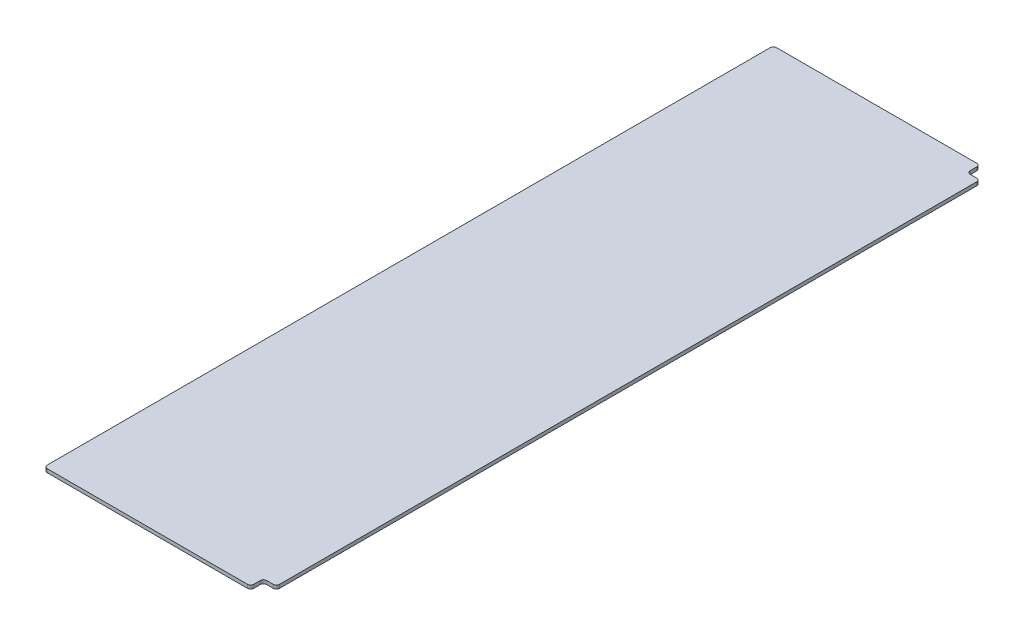
ISO-10303-21;
HEADER;
FILE_DESCRIPTION(('STEP AP214'),'2;1');
FILE_NAME('part.step','',(''),(''),'','','');
FILE_SCHEMA(('AUTOMOTIVE_DESIGN { 1 0 10303 214 1 1 1 1 }'));
ENDSEC;
DATA;
#1=APPLICATION_CONTEXT('core data for automotive mechanical design processes');
#2=APPLICATION_PROTOCOL_DEFINITION('international standard','automotive_design',2000,#1);
#3=PRODUCT_CONTEXT('',#1,'mechanical');
#4=PRODUCT('Part','Part','',(#3));
#5=PRODUCT_RELATED_PRODUCT_CATEGORY('part','',(#4));
#6=PRODUCT_DEFINITION_FORMATION('','',#4);
#7=PRODUCT_DEFINITION_CONTEXT('part definition',#1,'design');
#8=PRODUCT_DEFINITION('design','',#6,#7);
#9=PRODUCT_DEFINITION_SHAPE('','',#8);
#10=(LENGTH_UNIT() NAMED_UNIT(*) SI_UNIT(.MILLI.,.METRE.));
#11=(NAMED_UNIT(*) PLANE_ANGLE_UNIT() SI_UNIT($,.RADIAN.));
#12=(NAMED_UNIT(*) SI_UNIT($,.STERADIAN.) SOLID_ANGLE_UNIT());
#13=UNCERTAINTY_MEASURE_WITH_UNIT(LENGTH_MEASURE(1.E-05),#10,'distance_accuracy_value','');
#14=(GEOMETRIC_REPRESENTATION_CONTEXT(3) GLOBAL_UNCERTAINTY_ASSIGNED_CONTEXT((#13)) GLOBAL_UNIT_ASSIGNED_CONTEXT((#10,
#11,#12)) REPRESENTATION_CONTEXT('',''));
#15=CARTESIAN_POINT('',(0.,0.,0.));
#16=DIRECTION('',(0.,0.,1.));
#17=DIRECTION('',(1.,0.,0.));
#18=AXIS2_PLACEMENT_3D('',#15,#16,#17);
#19=CARTESIAN_POINT('',(190.5,2.778125,0.));
#20=DIRECTION('',(-1.,0.,0.));
#21=DIRECTION('',(0.,0.,1.));
#22=AXIS2_PLACEMENT_3D('',#19,#20,#21);
#23=PLANE('',#22);
#24=DIRECTION('',(0.,0.,-1.));
#25=VECTOR('',#24,1.);
#26=CARTESIAN_POINT('',(190.5,2.778125,0.));
#27=LINE('',#26,#25);
#28=CARTESIAN_POINT('',(190.5,2.778125,-30.48));
#29=VERTEX_POINT('',#28);
#30=CARTESIAN_POINT('',(190.5,2.778125,-579.12));
#31=VERTEX_POINT('',#30);
#32=EDGE_CURVE('E182',#29,#31,#27,.T.);
#33=ORIENTED_EDGE('',*,*,#32,.F.);
#34=DIRECTION('',(0.,1.,0.));
#35=VECTOR('',#34,1.);
#36=CARTESIAN_POINT('',(190.5,2.778125,-30.48));
#37=LINE('',#36,#35);
#38=CARTESIAN_POINT('',(190.5,0.,-30.48));
#39=VERTEX_POINT('',#38);
#40=EDGE_CURVE('E238',#29,#39,#37,.F.);
#41=ORIENTED_EDGE('',*,*,#40,.T.);
#42=DIRECTION('',(0.,0.,-1.));
#43=VECTOR('',#42,1.);
#44=CARTESIAN_POINT('',(190.5,0.,0.));
#45=LINE('',#44,#43);
#46=CARTESIAN_POINT('',(190.5,0.,-579.12));
#47=VERTEX_POINT('',#46);
#48=EDGE_CURVE('E185',#39,#47,#45,.T.);
#49=ORIENTED_EDGE('',*,*,#48,.T.);
#50=DIRECTION('',(0.,1.,0.));
#51=VECTOR('',#50,1.);
#52=CARTESIAN_POINT('',(190.5,2.778125,-579.12));
#53=LINE('',#52,#51);
#54=EDGE_CURVE('E235',#47,#31,#53,.T.);
#55=ORIENTED_EDGE('',*,*,#54,.T.);
#56=EDGE_LOOP('',(#33,#41,#49,#55));
#57=FACE_BOUND('',#56,.T.);
#58=ADVANCED_FACE('F33',(#57),#23,.F.);
#59=CARTESIAN_POINT('',(0.,2.778125,0.));
#60=DIRECTION('',(0.,-1.,0.));
#61=DIRECTION('',(0.,0.,-1.));
#62=AXIS2_PLACEMENT_3D('',#59,#60,#61);
#63=PLANE('',#62);
#64=DIRECTION('',(1.,0.,0.));
#65=VECTOR('',#64,1.);
#66=CARTESIAN_POINT('',(0.,2.778125,-591.82));
#67=LINE('',#66,#65);
#68=CARTESIAN_POINT('',(20.32,2.778125,-591.82));
#69=VERTEX_POINT('',#68);
#70=CARTESIAN_POINT('',(177.8,2.778125,-591.82));
#71=VERTEX_POINT('',#70);
#72=EDGE_CURVE('E164',#69,#71,#67,.T.);
#73=ORIENTED_EDGE('',*,*,#72,.F.);
#74=CARTESIAN_POINT('',(20.32,2.778125,-589.28));
#75=DIRECTION('',(0.,-1.,0.));
#76=DIRECTION('',(0.,0.,-1.));
#77=AXIS2_PLACEMENT_3D('',#74,#75,#76);
#78=CIRCLE('',#77,2.54);
#79=CARTESIAN_POINT('',(17.78,2.778125,-589.28));
#80=VERTEX_POINT('',#79);
#81=EDGE_CURVE('E147',#69,#80,#78,.F.);
#82=ORIENTED_EDGE('',*,*,#81,.T.);
#83=DIRECTION('',(0.,0.,-1.));
#84=VECTOR('',#83,1.);
#85=CARTESIAN_POINT('',(17.78,2.778125,-591.82));
#86=LINE('',#85,#84);
#87=CARTESIAN_POINT('',(17.78,2.778125,-20.32));
#88=VERTEX_POINT('',#87);
#89=EDGE_CURVE('E178',#88,#80,#86,.T.);
#90=ORIENTED_EDGE('',*,*,#89,.F.);
#91=CARTESIAN_POINT('',(20.32,2.778125,-20.32));
#92=DIRECTION('',(0.,-1.,0.));
#93=DIRECTION('',(0.,0.,-1.));
#94=AXIS2_PLACEMENT_3D('',#91,#92,#93);
#95=CIRCLE('',#94,2.54);
#96=CARTESIAN_POINT('',(20.32,2.778125,-17.78));
#97=VERTEX_POINT('',#96);
#98=EDGE_CURVE('E158',#88,#97,#95,.F.);
#99=ORIENTED_EDGE('',*,*,#98,.T.);
#100=DIRECTION('',(-1.,0.,0.));
#101=VECTOR('',#100,1.);
#102=CARTESIAN_POINT('',(0.,2.778125,-17.78));
#103=LINE('',#102,#101);
#104=CARTESIAN_POINT('',(177.8,2.778125,-17.78));
#105=VERTEX_POINT('',#104);
#106=EDGE_CURVE('E175',#105,#97,#103,.T.);
#107=ORIENTED_EDGE('',*,*,#106,.F.);
#108=CARTESIAN_POINT('',(177.8,2.778125,-20.32));
#109=DIRECTION('',(0.,-1.,0.));
#110=DIRECTION('',(0.,0.,-1.));
#111=AXIS2_PLACEMENT_3D('',#108,#109,#110);
#112=CIRCLE('',#111,2.54);
#113=CARTESIAN_POINT('',(180.34,2.778125,-20.32));
#114=VERTEX_POINT('',#113);
#115=EDGE_CURVE('E192',#105,#114,#112,.F.);
#116=ORIENTED_EDGE('',*,*,#115,.T.);
#117=DIRECTION('',(0.,0.,1.));
#118=VECTOR('',#117,1.);
#119=CARTESIAN_POINT('',(180.34,2.778125,-17.78));
#120=LINE('',#119,#118);
#121=CARTESIAN_POINT('',(180.34,2.778125,-25.4));
#122=VERTEX_POINT('',#121);
#123=EDGE_CURVE('E272',#122,#114,#120,.T.);
#124=ORIENTED_EDGE('',*,*,#123,.F.);
#125=CARTESIAN_POINT('',(182.88,2.778125,-25.4));
#126=DIRECTION('',(0.,-1.,0.));
#127=DIRECTION('',(0.,0.,-1.));
#128=AXIS2_PLACEMENT_3D('',#125,#126,#127);
#129=CIRCLE('',#128,2.54);
#130=CARTESIAN_POINT('',(182.88,2.778125,-27.94));
#131=VERTEX_POINT('',#130);
#132=EDGE_CURVE('E240',#122,#131,#129,.T.);
#133=ORIENTED_EDGE('',*,*,#132,.T.);
#134=DIRECTION('',(-1.,0.,0.));
#135=VECTOR('',#134,1.);
#136=CARTESIAN_POINT('',(190.5,2.778125,-27.94));
#137=LINE('',#136,#135);
#138=CARTESIAN_POINT('',(187.96,2.778125,-27.94));
#139=VERTEX_POINT('',#138);
#140=EDGE_CURVE('E275',#139,#131,#137,.T.);
#141=ORIENTED_EDGE('',*,*,#140,.F.);
#142=CARTESIAN_POINT('',(187.96,2.778125,-30.48));
#143=DIRECTION('',(0.,-1.,0.));
#144=DIRECTION('',(0.,0.,-1.));
#145=AXIS2_PLACEMENT_3D('',#142,#143,#144);
#146=CIRCLE('',#145,2.54);
#147=EDGE_CURVE('E194',#139,#29,#146,.F.);
#148=ORIENTED_EDGE('',*,*,#147,.T.);
#149=ORIENTED_EDGE('',*,*,#32,.T.);
#150=CARTESIAN_POINT('',(187.96,2.778125,-579.12));
#151=DIRECTION('',(0.,-1.,0.));
#152=DIRECTION('',(0.,0.,-1.));
#153=AXIS2_PLACEMENT_3D('',#150,#151,#152);
#154=CIRCLE('',#153,2.54);
#155=CARTESIAN_POINT('',(187.96,2.778125,-581.66));
#156=VERTEX_POINT('',#155);
#157=EDGE_CURVE('E167',#31,#156,#154,.F.);
#158=ORIENTED_EDGE('',*,*,#157,.T.);
#159=DIRECTION('',(1.,0.,0.));
#160=VECTOR('',#159,1.);
#161=CARTESIAN_POINT('',(190.5,2.778125,-581.66));
#162=LINE('',#161,#160);
#163=CARTESIAN_POINT('',(182.88,2.778125,-581.66));
#164=VERTEX_POINT('',#163);
#165=EDGE_CURVE('E246',#164,#156,#162,.T.);
#166=ORIENTED_EDGE('',*,*,#165,.F.);
#167=CARTESIAN_POINT('',(182.88,2.778125,-584.2));
#168=DIRECTION('',(0.,-1.,0.));
#169=DIRECTION('',(0.,0.,-1.));
#170=AXIS2_PLACEMENT_3D('',#167,#168,#169);
#171=CIRCLE('',#170,2.54);
#172=CARTESIAN_POINT('',(180.34,2.778125,-584.2));
#173=VERTEX_POINT('',#172);
#174=EDGE_CURVE('E41',#164,#173,#171,.T.);
#175=ORIENTED_EDGE('',*,*,#174,.T.);
#176=DIRECTION('',(0.,0.,1.));
#177=VECTOR('',#176,1.);
#178=CARTESIAN_POINT('',(180.34,2.778125,-591.82));
#179=LINE('',#178,#177);
#180=CARTESIAN_POINT('',(180.34,2.778125,-589.28));
#181=VERTEX_POINT('',#180);
#182=EDGE_CURVE('E244',#181,#173,#179,.T.);
#183=ORIENTED_EDGE('',*,*,#182,.F.);
#184=CARTESIAN_POINT('',(177.8,2.778125,-589.28));
#185=DIRECTION('',(0.,-1.,0.));
#186=DIRECTION('',(0.,0.,-1.));
#187=AXIS2_PLACEMENT_3D('',#184,#185,#186);
#188=CIRCLE('',#187,2.54);
#189=EDGE_CURVE('E172',#181,#71,#188,.F.);
#190=ORIENTED_EDGE('',*,*,#189,.T.);
#191=EDGE_LOOP('',(#73,#82,#90,#99,#107,#116,#124,#133,#141,#148,#149,#158,#166,#175,#183,#190));
#192=FACE_BOUND('',#191,.T.);
#193=ADVANCED_FACE('F170',(#192),#63,.F.);
#194=CARTESIAN_POINT('',(0.,0.,0.));
#195=DIRECTION('',(0.,-1.,0.));
#196=DIRECTION('',(0.,0.,-1.));
#197=AXIS2_PLACEMENT_3D('',#194,#195,#196);
#198=PLANE('',#197);
#199=DIRECTION('',(0.,0.,-1.));
#200=VECTOR('',#199,1.);
#201=CARTESIAN_POINT('',(17.78,0.,-591.82));
#202=LINE('',#201,#200);
#203=CARTESIAN_POINT('',(17.78,0.,-20.32));
#204=VERTEX_POINT('',#203);
#205=CARTESIAN_POINT('',(17.78,0.,-589.28));
#206=VERTEX_POINT('',#205);
#207=EDGE_CURVE('E173',#204,#206,#202,.T.);
#208=ORIENTED_EDGE('',*,*,#207,.T.);
#209=CARTESIAN_POINT('',(20.32,0.,-589.28));
#210=DIRECTION('',(0.,-1.,0.));
#211=DIRECTION('',(0.,0.,-1.));
#212=AXIS2_PLACEMENT_3D('',#209,#210,#211);
#213=CIRCLE('',#212,2.54);
#214=CARTESIAN_POINT('',(20.32,0.,-591.82));
#215=VERTEX_POINT('',#214);
#216=EDGE_CURVE('E209',#206,#215,#213,.T.);
#217=ORIENTED_EDGE('',*,*,#216,.T.);
#218=DIRECTION('',(1.,0.,0.));
#219=VECTOR('',#218,1.);
#220=CARTESIAN_POINT('',(0.,0.,-591.82));
#221=LINE('',#220,#219);
#222=CARTESIAN_POINT('',(177.8,0.,-591.82));
#223=VERTEX_POINT('',#222);
#224=EDGE_CURVE('E166',#215,#223,#221,.T.);
#225=ORIENTED_EDGE('',*,*,#224,.T.);
#226=CARTESIAN_POINT('',(177.8,0.,-589.28));
#227=DIRECTION('',(0.,-1.,0.));
#228=DIRECTION('',(0.,0.,-1.));
#229=AXIS2_PLACEMENT_3D('',#226,#227,#228);
#230=CIRCLE('',#229,2.54);
#231=CARTESIAN_POINT('',(180.34,0.,-589.28));
#232=VERTEX_POINT('',#231);
#233=EDGE_CURVE('E55',#223,#232,#230,.T.);
#234=ORIENTED_EDGE('',*,*,#233,.T.);
#235=DIRECTION('',(0.,0.,1.));
#236=VECTOR('',#235,1.);
#237=CARTESIAN_POINT('',(180.34,0.,-591.82));
#238=LINE('',#237,#236);
#239=CARTESIAN_POINT('',(180.34,0.,-584.2));
#240=VERTEX_POINT('',#239);
#241=EDGE_CURVE('E260',#232,#240,#238,.T.);
#242=ORIENTED_EDGE('',*,*,#241,.T.);
#243=CARTESIAN_POINT('',(182.88,0.,-584.2));
#244=DIRECTION('',(0.,-1.,0.));
#245=DIRECTION('',(0.,0.,-1.));
#246=AXIS2_PLACEMENT_3D('',#243,#244,#245);
#247=CIRCLE('',#246,2.54);
#248=CARTESIAN_POINT('',(182.88,0.,-581.66));
#249=VERTEX_POINT('',#248);
#250=EDGE_CURVE('E11',#240,#249,#247,.F.);
#251=ORIENTED_EDGE('',*,*,#250,.T.);
#252=DIRECTION('',(1.,0.,0.));
#253=VECTOR('',#252,1.);
#254=CARTESIAN_POINT('',(190.5,0.,-581.66));
#255=LINE('',#254,#253);
#256=CARTESIAN_POINT('',(187.96,0.,-581.66));
#257=VERTEX_POINT('',#256);
#258=EDGE_CURVE('E258',#249,#257,#255,.T.);
#259=ORIENTED_EDGE('',*,*,#258,.T.);
#260=CARTESIAN_POINT('',(187.96,0.,-579.12));
#261=DIRECTION('',(0.,-1.,0.));
#262=DIRECTION('',(0.,0.,-1.));
#263=AXIS2_PLACEMENT_3D('',#260,#261,#262);
#264=CIRCLE('',#263,2.54);
#265=EDGE_CURVE('E200',#257,#47,#264,.T.);
#266=ORIENTED_EDGE('',*,*,#265,.T.);
#267=ORIENTED_EDGE('',*,*,#48,.F.);
#268=CARTESIAN_POINT('',(187.96,0.,-30.48));
#269=DIRECTION('',(0.,-1.,0.));
#270=DIRECTION('',(0.,0.,-1.));
#271=AXIS2_PLACEMENT_3D('',#268,#269,#270);
#272=CIRCLE('',#271,2.54);
#273=CARTESIAN_POINT('',(187.96,0.,-27.94));
#274=VERTEX_POINT('',#273);
#275=EDGE_CURVE('E205',#39,#274,#272,.T.);
#276=ORIENTED_EDGE('',*,*,#275,.T.);
#277=DIRECTION('',(-1.,0.,0.));
#278=VECTOR('',#277,1.);
#279=CARTESIAN_POINT('',(190.5,0.,-27.94));
#280=LINE('',#279,#278);
#281=CARTESIAN_POINT('',(182.88,0.,-27.94));
#282=VERTEX_POINT('',#281);
#283=EDGE_CURVE('E269',#274,#282,#280,.T.);
#284=ORIENTED_EDGE('',*,*,#283,.T.);
#285=CARTESIAN_POINT('',(182.88,0.,-25.4));
#286=DIRECTION('',(0.,-1.,0.));
#287=DIRECTION('',(0.,0.,-1.));
#288=AXIS2_PLACEMENT_3D('',#285,#286,#287);
#289=CIRCLE('',#288,2.54);
#290=CARTESIAN_POINT('',(180.34,0.,-25.4));
#291=VERTEX_POINT('',#290);
#292=EDGE_CURVE('E242',#282,#291,#289,.F.);
#293=ORIENTED_EDGE('',*,*,#292,.T.);
#294=DIRECTION('',(0.,0.,1.));
#295=VECTOR('',#294,1.);
#296=CARTESIAN_POINT('',(180.34,0.,-17.78));
#297=LINE('',#296,#295);
#298=CARTESIAN_POINT('',(180.34,0.,-20.32));
#299=VERTEX_POINT('',#298);
#300=EDGE_CURVE('E251',#291,#299,#297,.T.);
#301=ORIENTED_EDGE('',*,*,#300,.T.);
#302=CARTESIAN_POINT('',(177.8,0.,-20.32));
#303=DIRECTION('',(0.,-1.,0.));
#304=DIRECTION('',(0.,0.,-1.));
#305=AXIS2_PLACEMENT_3D('',#302,#303,#304);
#306=CIRCLE('',#305,2.54);
#307=CARTESIAN_POINT('',(177.8,0.,-17.78));
#308=VERTEX_POINT('',#307);
#309=EDGE_CURVE('E203',#299,#308,#306,.T.);
#310=ORIENTED_EDGE('',*,*,#309,.T.);
#311=DIRECTION('',(-1.,0.,0.));
#312=VECTOR('',#311,1.);
#313=CARTESIAN_POINT('',(0.,0.,-17.78));
#314=LINE('',#313,#312);
#315=CARTESIAN_POINT('',(20.32,0.,-17.78));
#316=VERTEX_POINT('',#315);
#317=EDGE_CURVE('E188',#308,#316,#314,.T.);
#318=ORIENTED_EDGE('',*,*,#317,.T.);
#319=CARTESIAN_POINT('',(20.32,0.,-20.32));
#320=DIRECTION('',(0.,-1.,0.));
#321=DIRECTION('',(0.,0.,-1.));
#322=AXIS2_PLACEMENT_3D('',#319,#320,#321);
#323=CIRCLE('',#322,2.54);
#324=EDGE_CURVE('E207',#316,#204,#323,.T.);
#325=ORIENTED_EDGE('',*,*,#324,.T.);
#326=EDGE_LOOP('',(#208,#217,#225,#234,#242,#251,#259,#266,#267,#276,#284,#293,#301,#310,#318,#325));
#327=FACE_BOUND('',#326,.T.);
#328=ADVANCED_FACE('F257',(#327),#198,.T.);
#329=CARTESIAN_POINT('',(0.,0.,-591.82));
#330=DIRECTION('',(0.,0.,1.));
#331=DIRECTION('',(1.,0.,0.));
#332=AXIS2_PLACEMENT_3D('',#329,#330,#331);
#333=PLANE('',#332);
#334=ORIENTED_EDGE('',*,*,#224,.F.);
#335=DIRECTION('',(0.,1.,0.));
#336=VECTOR('',#335,1.);
#337=CARTESIAN_POINT('',(20.32,0.,-591.82));
#338=LINE('',#337,#336);
#339=EDGE_CURVE('E151',#215,#69,#338,.T.);
#340=ORIENTED_EDGE('',*,*,#339,.T.);
#341=ORIENTED_EDGE('',*,*,#72,.T.);
#342=DIRECTION('',(0.,1.,0.));
#343=VECTOR('',#342,1.);
#344=CARTESIAN_POINT('',(177.8,0.,-591.82));
#345=LINE('',#344,#343);
#346=EDGE_CURVE('E168',#71,#223,#345,.F.);
#347=ORIENTED_EDGE('',*,*,#346,.T.);
#348=EDGE_LOOP('',(#334,#340,#341,#347));
#349=FACE_BOUND('',#348,.T.);
#350=ADVANCED_FACE('F163',(#349),#333,.F.);
#351=CARTESIAN_POINT('',(0.,0.,-17.78));
#352=DIRECTION('',(0.,0.,-1.));
#353=DIRECTION('',(-1.,0.,0.));
#354=AXIS2_PLACEMENT_3D('',#351,#352,#353);
#355=PLANE('',#354);
#356=ORIENTED_EDGE('',*,*,#106,.T.);
#357=DIRECTION('',(0.,1.,0.));
#358=VECTOR('',#357,1.);
#359=CARTESIAN_POINT('',(20.32,0.,-17.78));
#360=LINE('',#359,#358);
#361=EDGE_CURVE('E214',#97,#316,#360,.F.);
#362=ORIENTED_EDGE('',*,*,#361,.T.);
#363=ORIENTED_EDGE('',*,*,#317,.F.);
#364=DIRECTION('',(0.,1.,0.));
#365=VECTOR('',#364,1.);
#366=CARTESIAN_POINT('',(177.8,0.,-17.78));
#367=LINE('',#366,#365);
#368=EDGE_CURVE('E211',#308,#105,#367,.T.);
#369=ORIENTED_EDGE('',*,*,#368,.T.);
#370=EDGE_LOOP('',(#356,#362,#363,#369));
#371=FACE_BOUND('',#370,.T.);
#372=ADVANCED_FACE('F285',(#371),#355,.F.);
#373=CARTESIAN_POINT('',(17.78,0.,-591.82));
#374=DIRECTION('',(1.,0.,0.));
#375=DIRECTION('',(0.,0.,-1.));
#376=AXIS2_PLACEMENT_3D('',#373,#374,#375);
#377=PLANE('',#376);
#378=ORIENTED_EDGE('',*,*,#89,.T.);
#379=DIRECTION('',(0.,1.,0.));
#380=VECTOR('',#379,1.);
#381=CARTESIAN_POINT('',(17.78,0.,-589.28));
#382=LINE('',#381,#380);
#383=EDGE_CURVE('E152',#80,#206,#382,.F.);
#384=ORIENTED_EDGE('',*,*,#383,.T.);
#385=ORIENTED_EDGE('',*,*,#207,.F.);
#386=DIRECTION('',(0.,1.,0.));
#387=VECTOR('',#386,1.);
#388=CARTESIAN_POINT('',(17.78,0.,-20.32));
#389=LINE('',#388,#387);
#390=EDGE_CURVE('E157',#204,#88,#389,.T.);
#391=ORIENTED_EDGE('',*,*,#390,.T.);
#392=EDGE_LOOP('',(#378,#384,#385,#391));
#393=FACE_BOUND('',#392,.T.);
#394=ADVANCED_FACE('F294',(#393),#377,.F.);
#395=CARTESIAN_POINT('',(180.34,0.,-17.78));
#396=DIRECTION('',(-1.,0.,0.));
#397=DIRECTION('',(0.,0.,1.));
#398=AXIS2_PLACEMENT_3D('',#395,#396,#397);
#399=PLANE('',#398);
#400=ORIENTED_EDGE('',*,*,#300,.F.);
#401=DIRECTION('',(0.,1.,0.));
#402=VECTOR('',#401,1.);
#403=CARTESIAN_POINT('',(180.34,2.778125,-25.4));
#404=LINE('',#403,#402);
#405=EDGE_CURVE('E218',#291,#122,#404,.T.);
#406=ORIENTED_EDGE('',*,*,#405,.T.);
#407=ORIENTED_EDGE('',*,*,#123,.T.);
#408=DIRECTION('',(0.,1.,0.));
#409=VECTOR('',#408,1.);
#410=CARTESIAN_POINT('',(180.34,0.,-20.32));
#411=LINE('',#410,#409);
#412=EDGE_CURVE('E216',#114,#299,#411,.F.);
#413=ORIENTED_EDGE('',*,*,#412,.T.);
#414=EDGE_LOOP('',(#400,#406,#407,#413));
#415=FACE_BOUND('',#414,.T.);
#416=ADVANCED_FACE('F296',(#415),#399,.F.);
#417=CARTESIAN_POINT('',(190.5,0.,-27.94));
#418=DIRECTION('',(0.,0.,-1.));
#419=DIRECTION('',(-1.,0.,0.));
#420=AXIS2_PLACEMENT_3D('',#417,#418,#419);
#421=PLANE('',#420);
#422=ORIENTED_EDGE('',*,*,#140,.T.);
#423=DIRECTION('',(0.,1.,0.));
#424=VECTOR('',#423,1.);
#425=CARTESIAN_POINT('',(182.88,0.,-27.94));
#426=LINE('',#425,#424);
#427=EDGE_CURVE('E224',#131,#282,#426,.F.);
#428=ORIENTED_EDGE('',*,*,#427,.T.);
#429=ORIENTED_EDGE('',*,*,#283,.F.);
#430=DIRECTION('',(0.,1.,0.));
#431=VECTOR('',#430,1.);
#432=CARTESIAN_POINT('',(187.96,0.,-27.94));
#433=LINE('',#432,#431);
#434=EDGE_CURVE('E221',#274,#139,#433,.T.);
#435=ORIENTED_EDGE('',*,*,#434,.T.);
#436=EDGE_LOOP('',(#422,#428,#429,#435));
#437=FACE_BOUND('',#436,.T.);
#438=ADVANCED_FACE('F302',(#437),#421,.F.);
#439=CARTESIAN_POINT('',(190.5,0.,-581.66));
#440=DIRECTION('',(0.,0.,1.));
#441=DIRECTION('',(1.,0.,0.));
#442=AXIS2_PLACEMENT_3D('',#439,#440,#441);
#443=PLANE('',#442);
#444=ORIENTED_EDGE('',*,*,#258,.F.);
#445=DIRECTION('',(0.,1.,0.));
#446=VECTOR('',#445,1.);
#447=CARTESIAN_POINT('',(182.88,2.778125,-581.66));
#448=LINE('',#447,#446);
#449=EDGE_CURVE('E228',#249,#164,#448,.T.);
#450=ORIENTED_EDGE('',*,*,#449,.T.);
#451=ORIENTED_EDGE('',*,*,#165,.T.);
#452=DIRECTION('',(0.,1.,0.));
#453=VECTOR('',#452,1.);
#454=CARTESIAN_POINT('',(187.96,0.,-581.66));
#455=LINE('',#454,#453);
#456=EDGE_CURVE('E226',#156,#257,#455,.F.);
#457=ORIENTED_EDGE('',*,*,#456,.T.);
#458=EDGE_LOOP('',(#444,#450,#451,#457));
#459=FACE_BOUND('',#458,.T.);
#460=ADVANCED_FACE('F262',(#459),#443,.F.);
#461=CARTESIAN_POINT('',(180.34,0.,-591.82));
#462=DIRECTION('',(-1.,0.,0.));
#463=DIRECTION('',(0.,0.,1.));
#464=AXIS2_PLACEMENT_3D('',#461,#462,#463);
#465=PLANE('',#464);
#466=ORIENTED_EDGE('',*,*,#182,.T.);
#467=DIRECTION('',(0.,1.,0.));
#468=VECTOR('',#467,1.);
#469=CARTESIAN_POINT('',(180.34,0.,-584.2));
#470=LINE('',#469,#468);
#471=EDGE_CURVE('E48',#173,#240,#470,.F.);
#472=ORIENTED_EDGE('',*,*,#471,.T.);
#473=ORIENTED_EDGE('',*,*,#241,.F.);
#474=DIRECTION('',(0.,1.,0.));
#475=VECTOR('',#474,1.);
#476=CARTESIAN_POINT('',(180.34,0.,-589.28));
#477=LINE('',#476,#475);
#478=EDGE_CURVE('E231',#232,#181,#477,.T.);
#479=ORIENTED_EDGE('',*,*,#478,.T.);
#480=EDGE_LOOP('',(#466,#472,#473,#479));
#481=FACE_BOUND('',#480,.T.);
#482=ADVANCED_FACE('F249',(#481),#465,.F.);
#483=CARTESIAN_POINT('',(20.32,0.,-589.28));
#484=DIRECTION('',(0.,1.,0.));
#485=DIRECTION('',(0.,0.,1.));
#486=AXIS2_PLACEMENT_3D('',#483,#484,#485);
#487=CYLINDRICAL_SURFACE('',#486,2.54);
#488=ORIENTED_EDGE('',*,*,#216,.F.);
#489=ORIENTED_EDGE('',*,*,#383,.F.);
#490=ORIENTED_EDGE('',*,*,#81,.F.);
#491=ORIENTED_EDGE('',*,*,#339,.F.);
#492=EDGE_LOOP('',(#488,#489,#490,#491));
#493=FACE_BOUND('',#492,.T.);
#494=ADVANCED_FACE('F150',(#493),#487,.T.);
#495=CARTESIAN_POINT('',(20.32,0.,-20.32));
#496=DIRECTION('',(0.,1.,0.));
#497=DIRECTION('',(0.,0.,1.));
#498=AXIS2_PLACEMENT_3D('',#495,#496,#497);
#499=CYLINDRICAL_SURFACE('',#498,2.54);
#500=ORIENTED_EDGE('',*,*,#324,.F.);
#501=ORIENTED_EDGE('',*,*,#361,.F.);
#502=ORIENTED_EDGE('',*,*,#98,.F.);
#503=ORIENTED_EDGE('',*,*,#390,.F.);
#504=EDGE_LOOP('',(#500,#501,#502,#503));
#505=FACE_BOUND('',#504,.T.);
#506=ADVANCED_FACE('F290',(#505),#499,.T.);
#507=CARTESIAN_POINT('',(182.88,0.,-25.4));
#508=DIRECTION('',(0.,-1.,0.));
#509=DIRECTION('',(0.,0.,-1.));
#510=AXIS2_PLACEMENT_3D('',#507,#508,#509);
#511=CYLINDRICAL_SURFACE('',#510,2.54);
#512=ORIENTED_EDGE('',*,*,#292,.F.);
#513=ORIENTED_EDGE('',*,*,#427,.F.);
#514=ORIENTED_EDGE('',*,*,#132,.F.);
#515=ORIENTED_EDGE('',*,*,#405,.F.);
#516=EDGE_LOOP('',(#512,#513,#514,#515));
#517=FACE_BOUND('',#516,.T.);
#518=ADVANCED_FACE('F321',(#517),#511,.F.);
#519=CARTESIAN_POINT('',(182.88,0.,-584.2));
#520=DIRECTION('',(0.,-1.,0.));
#521=DIRECTION('',(0.,0.,-1.));
#522=AXIS2_PLACEMENT_3D('',#519,#520,#521);
#523=CYLINDRICAL_SURFACE('',#522,2.54);
#524=ORIENTED_EDGE('',*,*,#250,.F.);
#525=ORIENTED_EDGE('',*,*,#471,.F.);
#526=ORIENTED_EDGE('',*,*,#174,.F.);
#527=ORIENTED_EDGE('',*,*,#449,.F.);
#528=EDGE_LOOP('',(#524,#525,#526,#527));
#529=FACE_BOUND('',#528,.T.);
#530=ADVANCED_FACE('F254',(#529),#523,.F.);
#531=CARTESIAN_POINT('',(187.96,0.,-30.48));
#532=DIRECTION('',(0.,1.,0.));
#533=DIRECTION('',(0.,0.,1.));
#534=AXIS2_PLACEMENT_3D('',#531,#532,#533);
#535=CYLINDRICAL_SURFACE('',#534,2.54);
#536=ORIENTED_EDGE('',*,*,#275,.F.);
#537=ORIENTED_EDGE('',*,*,#40,.F.);
#538=ORIENTED_EDGE('',*,*,#147,.F.);
#539=ORIENTED_EDGE('',*,*,#434,.F.);
#540=EDGE_LOOP('',(#536,#537,#538,#539));
#541=FACE_BOUND('',#540,.T.);
#542=ADVANCED_FACE('F327',(#541),#535,.T.);
#543=CARTESIAN_POINT('',(177.8,0.,-20.32));
#544=DIRECTION('',(0.,1.,0.));
#545=DIRECTION('',(0.,0.,1.));
#546=AXIS2_PLACEMENT_3D('',#543,#544,#545);
#547=CYLINDRICAL_SURFACE('',#546,2.54);
#548=ORIENTED_EDGE('',*,*,#309,.F.);
#549=ORIENTED_EDGE('',*,*,#412,.F.);
#550=ORIENTED_EDGE('',*,*,#115,.F.);
#551=ORIENTED_EDGE('',*,*,#368,.F.);
#552=EDGE_LOOP('',(#548,#549,#550,#551));
#553=FACE_BOUND('',#552,.T.);
#554=ADVANCED_FACE('F330',(#553),#547,.T.);
#555=CARTESIAN_POINT('',(177.8,0.,-589.28));
#556=DIRECTION('',(0.,1.,0.));
#557=DIRECTION('',(0.,0.,1.));
#558=AXIS2_PLACEMENT_3D('',#555,#556,#557);
#559=CYLINDRICAL_SURFACE('',#558,2.54);
#560=ORIENTED_EDGE('',*,*,#233,.F.);
#561=ORIENTED_EDGE('',*,*,#346,.F.);
#562=ORIENTED_EDGE('',*,*,#189,.F.);
#563=ORIENTED_EDGE('',*,*,#478,.F.);
#564=EDGE_LOOP('',(#560,#561,#562,#563));
#565=FACE_BOUND('',#564,.T.);
#566=ADVANCED_FACE('F333',(#565),#559,.T.);
#567=CARTESIAN_POINT('',(187.96,2.778125,-579.12));
#568=DIRECTION('',(0.,1.,0.));
#569=DIRECTION('',(0.,0.,1.));
#570=AXIS2_PLACEMENT_3D('',#567,#568,#569);
#571=CYLINDRICAL_SURFACE('',#570,2.54);
#572=ORIENTED_EDGE('',*,*,#265,.F.);
#573=ORIENTED_EDGE('',*,*,#456,.F.);
#574=ORIENTED_EDGE('',*,*,#157,.F.);
#575=ORIENTED_EDGE('',*,*,#54,.F.);
#576=EDGE_LOOP('',(#572,#573,#574,#575));
#577=FACE_BOUND('',#576,.T.);
#578=ADVANCED_FACE('F35',(#577),#571,.T.);
#579=CLOSED_SHELL('',(#58,#193,#328,#350,#372,#394,#416,#438,#460,#482,#494,#506,#518,#530,#542,
#554,#566,#578));
#580=MANIFOLD_SOLID_BREP('B2',#579);
#581=ADVANCED_BREP_SHAPE_REPRESENTATION('',(#18,#580),#14);
#582=SHAPE_DEFINITION_REPRESENTATION(#9,#581);
ENDSEC;
END-ISO-10303-21;
